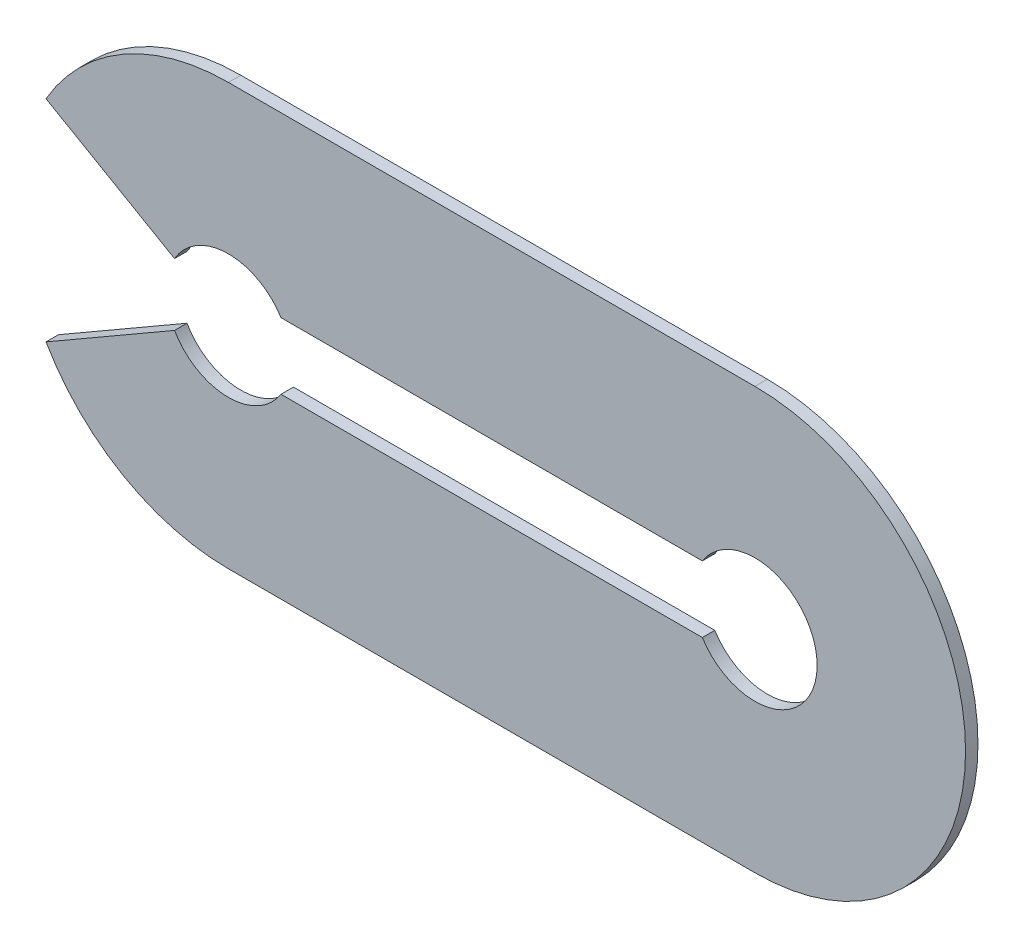
ISO-10303-21;
HEADER;
FILE_DESCRIPTION(('STEP AP214'),'2;1');
FILE_NAME('part.step','',(''),(''),'','','');
FILE_SCHEMA(('AUTOMOTIVE_DESIGN { 1 0 10303 214 1 1 1 1 }'));
ENDSEC;
DATA;
#1=APPLICATION_CONTEXT('core data for automotive mechanical design processes');
#2=APPLICATION_PROTOCOL_DEFINITION('international standard','automotive_design',2000,#1);
#3=PRODUCT_CONTEXT('',#1,'mechanical');
#4=PRODUCT('Part','Part','',(#3));
#5=PRODUCT_RELATED_PRODUCT_CATEGORY('part','',(#4));
#6=PRODUCT_DEFINITION_FORMATION('','',#4);
#7=PRODUCT_DEFINITION_CONTEXT('part definition',#1,'design');
#8=PRODUCT_DEFINITION('design','',#6,#7);
#9=PRODUCT_DEFINITION_SHAPE('','',#8);
#10=(LENGTH_UNIT() NAMED_UNIT(*) SI_UNIT(.MILLI.,.METRE.));
#11=(NAMED_UNIT(*) PLANE_ANGLE_UNIT() SI_UNIT($,.RADIAN.));
#12=(NAMED_UNIT(*) SI_UNIT($,.STERADIAN.) SOLID_ANGLE_UNIT());
#13=UNCERTAINTY_MEASURE_WITH_UNIT(LENGTH_MEASURE(1.E-05),#10,'distance_accuracy_value','');
#14=(GEOMETRIC_REPRESENTATION_CONTEXT(3) GLOBAL_UNCERTAINTY_ASSIGNED_CONTEXT((#13)) GLOBAL_UNIT_ASSIGNED_CONTEXT((#10,
#11,#12)) REPRESENTATION_CONTEXT('',''));
#15=CARTESIAN_POINT('',(0.,0.,0.));
#16=DIRECTION('',(0.,0.,1.));
#17=DIRECTION('',(1.,0.,0.));
#18=AXIS2_PLACEMENT_3D('',#15,#16,#17);
#19=CARTESIAN_POINT('',(-12.7,0.,-0.3));
#20=DIRECTION('',(0.,0.,1.));
#21=DIRECTION('',(1.,0.,0.));
#22=AXIS2_PLACEMENT_3D('',#19,#20,#21);
#23=CYLINDRICAL_SURFACE('',#22,1.5);
#24=CARTESIAN_POINT('',(-12.7,0.,0.));
#25=DIRECTION('',(0.,0.,-1.));
#26=DIRECTION('',(1.,0.,0.));
#27=AXIS2_PLACEMENT_3D('',#24,#25,#26);
#28=CIRCLE('',#27,1.5);
#29=CARTESIAN_POINT('',(-13.9990381056767,0.749999999999993,0.));
#30=VERTEX_POINT('',#29);
#31=CARTESIAN_POINT('',(-11.431142245955,0.799999999999998,0.));
#32=VERTEX_POINT('',#31);
#33=EDGE_CURVE('E120',#30,#32,#28,.T.);
#34=ORIENTED_EDGE('',*,*,#33,.F.);
#35=DIRECTION('',(0.,0.,1.));
#36=VECTOR('',#35,1.);
#37=CARTESIAN_POINT('',(-13.9990381056767,0.749999999999993,-0.3));
#38=LINE('',#37,#36);
#39=CARTESIAN_POINT('',(-13.9990381056767,0.749999999999993,-0.3));
#40=VERTEX_POINT('',#39);
#41=EDGE_CURVE('E11',#40,#30,#38,.T.);
#42=ORIENTED_EDGE('',*,*,#41,.F.);
#43=CARTESIAN_POINT('',(-12.7,0.,-0.3));
#44=DIRECTION('',(0.,0.,-1.));
#45=DIRECTION('',(1.,0.,0.));
#46=AXIS2_PLACEMENT_3D('',#43,#44,#45);
#47=CIRCLE('',#46,1.5);
#48=CARTESIAN_POINT('',(-11.431142245955,0.799999999999998,-0.3));
#49=VERTEX_POINT('',#48);
#50=EDGE_CURVE('E122',#40,#49,#47,.T.);
#51=ORIENTED_EDGE('',*,*,#50,.T.);
#52=DIRECTION('',(0.,0.,1.));
#53=VECTOR('',#52,1.);
#54=CARTESIAN_POINT('',(-11.431142245955,0.799999999999998,-0.3));
#55=LINE('',#54,#53);
#56=EDGE_CURVE('E35',#49,#32,#55,.T.);
#57=ORIENTED_EDGE('',*,*,#56,.T.);
#58=EDGE_LOOP('',(#34,#42,#51,#57));
#59=FACE_BOUND('',#58,.T.);
#60=ADVANCED_FACE('F32',(#59),#23,.F.);
#61=CARTESIAN_POINT('',(-13.9990381056767,0.749999999999993,-0.3));
#62=DIRECTION('',(-0.499999999999995,-0.866025403784441,0.));
#63=DIRECTION('',(0.866025403784442,-0.499999999999995,0.));
#64=AXIS2_PLACEMENT_3D('',#61,#62,#63);
#65=PLANE('',#64);
#66=DIRECTION('',(0.866025403784442,-0.499999999999995,0.));
#67=VECTOR('',#66,1.);
#68=CARTESIAN_POINT('',(-13.9990381056767,0.749999999999993,0.));
#69=LINE('',#68,#67);
#70=CARTESIAN_POINT('',(-17.099409051225,2.53999999999998,0.));
#71=VERTEX_POINT('',#70);
#72=EDGE_CURVE('E138',#71,#30,#69,.T.);
#73=ORIENTED_EDGE('',*,*,#72,.F.);
#74=DIRECTION('',(0.,0.,1.));
#75=VECTOR('',#74,1.);
#76=CARTESIAN_POINT('',(-17.099409051225,2.53999999999998,-0.3));
#77=LINE('',#76,#75);
#78=CARTESIAN_POINT('',(-17.099409051225,2.53999999999998,-0.3));
#79=VERTEX_POINT('',#78);
#80=EDGE_CURVE('E40',#79,#71,#77,.T.);
#81=ORIENTED_EDGE('',*,*,#80,.F.);
#82=DIRECTION('',(0.866025403784442,-0.499999999999995,0.));
#83=VECTOR('',#82,1.);
#84=CARTESIAN_POINT('',(-13.9990381056767,0.749999999999993,-0.3));
#85=LINE('',#84,#83);
#86=EDGE_CURVE('E127',#79,#40,#85,.T.);
#87=ORIENTED_EDGE('',*,*,#86,.T.);
#88=ORIENTED_EDGE('',*,*,#41,.T.);
#89=EDGE_LOOP('',(#73,#81,#87,#88));
#90=FACE_BOUND('',#89,.T.);
#91=ADVANCED_FACE('F245',(#90),#65,.T.);
#92=CARTESIAN_POINT('',(-12.7,0.,-0.3));
#93=DIRECTION('',(0.,0.,1.));
#94=DIRECTION('',(1.,0.,0.));
#95=AXIS2_PLACEMENT_3D('',#92,#93,#94);
#96=CYLINDRICAL_SURFACE('',#95,5.08);
#97=CARTESIAN_POINT('',(-12.7,0.,0.));
#98=DIRECTION('',(0.,0.,1.));
#99=DIRECTION('',(1.,0.,0.));
#100=AXIS2_PLACEMENT_3D('',#97,#98,#99);
#101=CIRCLE('',#100,5.08);
#102=CARTESIAN_POINT('',(-12.7,5.08,0.));
#103=VERTEX_POINT('',#102);
#104=EDGE_CURVE('E163',#103,#71,#101,.T.);
#105=ORIENTED_EDGE('',*,*,#104,.F.);
#106=DIRECTION('',(0.,0.,1.));
#107=VECTOR('',#106,1.);
#108=CARTESIAN_POINT('',(-12.7,5.08,-0.3));
#109=LINE('',#108,#107);
#110=CARTESIAN_POINT('',(-12.7,5.08,-0.3));
#111=VERTEX_POINT('',#110);
#112=EDGE_CURVE('E197',#111,#103,#109,.T.);
#113=ORIENTED_EDGE('',*,*,#112,.F.);
#114=CARTESIAN_POINT('',(-12.7,0.,-0.3));
#115=DIRECTION('',(0.,0.,1.));
#116=DIRECTION('',(1.,0.,0.));
#117=AXIS2_PLACEMENT_3D('',#114,#115,#116);
#118=CIRCLE('',#117,5.08);
#119=EDGE_CURVE('E193',#111,#79,#118,.T.);
#120=ORIENTED_EDGE('',*,*,#119,.T.);
#121=ORIENTED_EDGE('',*,*,#80,.T.);
#122=EDGE_LOOP('',(#105,#113,#120,#121));
#123=FACE_BOUND('',#122,.T.);
#124=ADVANCED_FACE('F250',(#123),#96,.T.);
#125=CARTESIAN_POINT('',(0.,5.08,-0.3));
#126=DIRECTION('',(0.,1.,0.));
#127=DIRECTION('',(0.,0.,1.));
#128=AXIS2_PLACEMENT_3D('',#125,#126,#127);
#129=PLANE('',#128);
#130=DIRECTION('',(-1.,0.,0.));
#131=VECTOR('',#130,1.);
#132=CARTESIAN_POINT('',(0.,5.08,0.));
#133=LINE('',#132,#131);
#134=CARTESIAN_POINT('',(0.,5.08,0.));
#135=VERTEX_POINT('',#134);
#136=EDGE_CURVE('E160',#135,#103,#133,.T.);
#137=ORIENTED_EDGE('',*,*,#136,.F.);
#138=DIRECTION('',(0.,0.,1.));
#139=VECTOR('',#138,1.);
#140=CARTESIAN_POINT('',(0.,5.08,-0.3));
#141=LINE('',#140,#139);
#142=CARTESIAN_POINT('',(0.,5.08,-0.3));
#143=VERTEX_POINT('',#142);
#144=EDGE_CURVE('E199',#143,#135,#141,.T.);
#145=ORIENTED_EDGE('',*,*,#144,.F.);
#146=DIRECTION('',(-1.,0.,0.));
#147=VECTOR('',#146,1.);
#148=CARTESIAN_POINT('',(0.,5.08,-0.3));
#149=LINE('',#148,#147);
#150=EDGE_CURVE('E190',#143,#111,#149,.T.);
#151=ORIENTED_EDGE('',*,*,#150,.T.);
#152=ORIENTED_EDGE('',*,*,#112,.T.);
#153=EDGE_LOOP('',(#137,#145,#151,#152));
#154=FACE_BOUND('',#153,.T.);
#155=ADVANCED_FACE('F242',(#154),#129,.T.);
#156=CARTESIAN_POINT('',(0.,0.,-0.3));
#157=DIRECTION('',(0.,0.,1.));
#158=DIRECTION('',(1.,0.,0.));
#159=AXIS2_PLACEMENT_3D('',#156,#157,#158);
#160=CYLINDRICAL_SURFACE('',#159,5.08);
#161=CARTESIAN_POINT('',(0.,0.,0.));
#162=DIRECTION('',(0.,0.,1.));
#163=DIRECTION('',(1.,0.,0.));
#164=AXIS2_PLACEMENT_3D('',#161,#162,#163);
#165=CIRCLE('',#164,5.08);
#166=CARTESIAN_POINT('',(0.,-5.08,0.));
#167=VERTEX_POINT('',#166);
#168=EDGE_CURVE('E157',#167,#135,#165,.T.);
#169=ORIENTED_EDGE('',*,*,#168,.F.);
#170=DIRECTION('',(0.,0.,1.));
#171=VECTOR('',#170,1.);
#172=CARTESIAN_POINT('',(0.,-5.08,-0.3));
#173=LINE('',#172,#171);
#174=CARTESIAN_POINT('',(0.,-5.08,-0.3));
#175=VERTEX_POINT('',#174);
#176=EDGE_CURVE('E201',#175,#167,#173,.T.);
#177=ORIENTED_EDGE('',*,*,#176,.F.);
#178=CARTESIAN_POINT('',(0.,0.,-0.3));
#179=DIRECTION('',(0.,0.,1.));
#180=DIRECTION('',(1.,0.,0.));
#181=AXIS2_PLACEMENT_3D('',#178,#179,#180);
#182=CIRCLE('',#181,5.08);
#183=EDGE_CURVE('E187',#175,#143,#182,.T.);
#184=ORIENTED_EDGE('',*,*,#183,.T.);
#185=ORIENTED_EDGE('',*,*,#144,.T.);
#186=EDGE_LOOP('',(#169,#177,#184,#185));
#187=FACE_BOUND('',#186,.T.);
#188=ADVANCED_FACE('F238',(#187),#160,.T.);
#189=CARTESIAN_POINT('',(0.,-5.08,-0.3));
#190=DIRECTION('',(0.,-1.,0.));
#191=DIRECTION('',(0.,0.,-1.));
#192=AXIS2_PLACEMENT_3D('',#189,#190,#191);
#193=PLANE('',#192);
#194=DIRECTION('',(1.,0.,0.));
#195=VECTOR('',#194,1.);
#196=CARTESIAN_POINT('',(0.,-5.08,0.));
#197=LINE('',#196,#195);
#198=CARTESIAN_POINT('',(-12.7,-5.08,0.));
#199=VERTEX_POINT('',#198);
#200=EDGE_CURVE('E154',#199,#167,#197,.T.);
#201=ORIENTED_EDGE('',*,*,#200,.F.);
#202=DIRECTION('',(0.,0.,1.));
#203=VECTOR('',#202,1.);
#204=CARTESIAN_POINT('',(-12.7,-5.08,-0.3));
#205=LINE('',#204,#203);
#206=CARTESIAN_POINT('',(-12.7,-5.08,-0.3));
#207=VERTEX_POINT('',#206);
#208=EDGE_CURVE('E203',#207,#199,#205,.T.);
#209=ORIENTED_EDGE('',*,*,#208,.F.);
#210=DIRECTION('',(1.,0.,0.));
#211=VECTOR('',#210,1.);
#212=CARTESIAN_POINT('',(0.,-5.08,-0.3));
#213=LINE('',#212,#211);
#214=EDGE_CURVE('E184',#207,#175,#213,.T.);
#215=ORIENTED_EDGE('',*,*,#214,.T.);
#216=ORIENTED_EDGE('',*,*,#176,.T.);
#217=EDGE_LOOP('',(#201,#209,#215,#216));
#218=FACE_BOUND('',#217,.T.);
#219=ADVANCED_FACE('F234',(#218),#193,.T.);
#220=CARTESIAN_POINT('',(-12.7,0.,-0.3));
#221=DIRECTION('',(0.,0.,1.));
#222=DIRECTION('',(1.,0.,0.));
#223=AXIS2_PLACEMENT_3D('',#220,#221,#222);
#224=CYLINDRICAL_SURFACE('',#223,5.08);
#225=CARTESIAN_POINT('',(-12.7,0.,0.));
#226=DIRECTION('',(0.,0.,1.));
#227=DIRECTION('',(1.,0.,0.));
#228=AXIS2_PLACEMENT_3D('',#225,#226,#227);
#229=CIRCLE('',#228,5.08);
#230=CARTESIAN_POINT('',(-17.099409051225,-2.53999999999997,0.));
#231=VERTEX_POINT('',#230);
#232=EDGE_CURVE('E151',#231,#199,#229,.T.);
#233=ORIENTED_EDGE('',*,*,#232,.F.);
#234=DIRECTION('',(0.,0.,1.));
#235=VECTOR('',#234,1.);
#236=CARTESIAN_POINT('',(-17.099409051225,-2.53999999999997,-0.3));
#237=LINE('',#236,#235);
#238=CARTESIAN_POINT('',(-17.099409051225,-2.53999999999997,-0.3));
#239=VERTEX_POINT('',#238);
#240=EDGE_CURVE('E205',#239,#231,#237,.T.);
#241=ORIENTED_EDGE('',*,*,#240,.F.);
#242=CARTESIAN_POINT('',(-12.7,0.,-0.3));
#243=DIRECTION('',(0.,0.,1.));
#244=DIRECTION('',(1.,0.,0.));
#245=AXIS2_PLACEMENT_3D('',#242,#243,#244);
#246=CIRCLE('',#245,5.08);
#247=EDGE_CURVE('E181',#239,#207,#246,.T.);
#248=ORIENTED_EDGE('',*,*,#247,.T.);
#249=ORIENTED_EDGE('',*,*,#208,.T.);
#250=EDGE_LOOP('',(#233,#241,#248,#249));
#251=FACE_BOUND('',#250,.T.);
#252=ADVANCED_FACE('F230',(#251),#224,.T.);
#253=CARTESIAN_POINT('',(-13.9990381056767,-0.749999999999993,-0.3));
#254=DIRECTION('',(-0.499999999999995,0.866025403784441,0.));
#255=DIRECTION('',(-0.866025403784442,-0.499999999999995,0.));
#256=AXIS2_PLACEMENT_3D('',#253,#254,#255);
#257=PLANE('',#256);
#258=DIRECTION('',(-0.866025403784442,-0.499999999999995,0.));
#259=VECTOR('',#258,1.);
#260=CARTESIAN_POINT('',(-13.9990381056767,-0.749999999999993,0.));
#261=LINE('',#260,#259);
#262=CARTESIAN_POINT('',(-13.9990381056767,-0.749999999999993,0.));
#263=VERTEX_POINT('',#262);
#264=EDGE_CURVE('E148',#263,#231,#261,.T.);
#265=ORIENTED_EDGE('',*,*,#264,.F.);
#266=DIRECTION('',(0.,0.,1.));
#267=VECTOR('',#266,1.);
#268=CARTESIAN_POINT('',(-13.9990381056767,-0.749999999999993,-0.3));
#269=LINE('',#268,#267);
#270=CARTESIAN_POINT('',(-13.9990381056767,-0.749999999999993,-0.3));
#271=VERTEX_POINT('',#270);
#272=EDGE_CURVE('E207',#271,#263,#269,.T.);
#273=ORIENTED_EDGE('',*,*,#272,.F.);
#274=DIRECTION('',(-0.866025403784442,-0.499999999999995,0.));
#275=VECTOR('',#274,1.);
#276=CARTESIAN_POINT('',(-13.9990381056767,-0.749999999999993,-0.3));
#277=LINE('',#276,#275);
#278=EDGE_CURVE('E178',#271,#239,#277,.T.);
#279=ORIENTED_EDGE('',*,*,#278,.T.);
#280=ORIENTED_EDGE('',*,*,#240,.T.);
#281=EDGE_LOOP('',(#265,#273,#279,#280));
#282=FACE_BOUND('',#281,.T.);
#283=ADVANCED_FACE('F226',(#282),#257,.T.);
#284=CARTESIAN_POINT('',(-12.7,0.,-0.3));
#285=DIRECTION('',(0.,0.,1.));
#286=DIRECTION('',(1.,0.,0.));
#287=AXIS2_PLACEMENT_3D('',#284,#285,#286);
#288=CYLINDRICAL_SURFACE('',#287,1.5);
#289=CARTESIAN_POINT('',(-12.7,0.,0.));
#290=DIRECTION('',(0.,0.,-1.));
#291=DIRECTION('',(1.,0.,0.));
#292=AXIS2_PLACEMENT_3D('',#289,#290,#291);
#293=CIRCLE('',#292,1.5);
#294=CARTESIAN_POINT('',(-11.431142245955,-0.800000000000002,0.));
#295=VERTEX_POINT('',#294);
#296=EDGE_CURVE('E145',#295,#263,#293,.T.);
#297=ORIENTED_EDGE('',*,*,#296,.F.);
#298=DIRECTION('',(0.,0.,1.));
#299=VECTOR('',#298,1.);
#300=CARTESIAN_POINT('',(-11.431142245955,-0.800000000000002,-0.3));
#301=LINE('',#300,#299);
#302=CARTESIAN_POINT('',(-11.431142245955,-0.800000000000002,-0.3));
#303=VERTEX_POINT('',#302);
#304=EDGE_CURVE('E209',#303,#295,#301,.T.);
#305=ORIENTED_EDGE('',*,*,#304,.F.);
#306=CARTESIAN_POINT('',(-12.7,0.,-0.3));
#307=DIRECTION('',(0.,0.,-1.));
#308=DIRECTION('',(1.,0.,0.));
#309=AXIS2_PLACEMENT_3D('',#306,#307,#308);
#310=CIRCLE('',#309,1.5);
#311=EDGE_CURVE('E175',#303,#271,#310,.T.);
#312=ORIENTED_EDGE('',*,*,#311,.T.);
#313=ORIENTED_EDGE('',*,*,#272,.T.);
#314=EDGE_LOOP('',(#297,#305,#312,#313));
#315=FACE_BOUND('',#314,.T.);
#316=ADVANCED_FACE('F222',(#315),#288,.F.);
#317=CARTESIAN_POINT('',(-1.26885775404495,-0.8,-0.3));
#318=DIRECTION('',(0.,1.,0.));
#319=DIRECTION('',(-1.,0.,0.));
#320=AXIS2_PLACEMENT_3D('',#317,#318,#319);
#321=PLANE('',#320);
#322=DIRECTION('',(-1.,0.,0.));
#323=VECTOR('',#322,1.);
#324=CARTESIAN_POINT('',(-1.26885775404495,-0.8,0.));
#325=LINE('',#324,#323);
#326=CARTESIAN_POINT('',(-1.26885775404495,-0.8,0.));
#327=VERTEX_POINT('',#326);
#328=EDGE_CURVE('E142',#327,#295,#325,.T.);
#329=ORIENTED_EDGE('',*,*,#328,.F.);
#330=DIRECTION('',(0.,0.,1.));
#331=VECTOR('',#330,1.);
#332=CARTESIAN_POINT('',(-1.26885775404495,-0.8,-0.3));
#333=LINE('',#332,#331);
#334=CARTESIAN_POINT('',(-1.26885775404495,-0.8,-0.3));
#335=VERTEX_POINT('',#334);
#336=EDGE_CURVE('E211',#335,#327,#333,.T.);
#337=ORIENTED_EDGE('',*,*,#336,.F.);
#338=DIRECTION('',(-1.,0.,0.));
#339=VECTOR('',#338,1.);
#340=CARTESIAN_POINT('',(-1.26885775404495,-0.8,-0.3));
#341=LINE('',#340,#339);
#342=EDGE_CURVE('E172',#335,#303,#341,.T.);
#343=ORIENTED_EDGE('',*,*,#342,.T.);
#344=ORIENTED_EDGE('',*,*,#304,.T.);
#345=EDGE_LOOP('',(#329,#337,#343,#344));
#346=FACE_BOUND('',#345,.T.);
#347=ADVANCED_FACE('F218',(#346),#321,.T.);
#348=CARTESIAN_POINT('',(0.,0.,-0.3));
#349=DIRECTION('',(0.,0.,1.));
#350=DIRECTION('',(1.,0.,0.));
#351=AXIS2_PLACEMENT_3D('',#348,#349,#350);
#352=CYLINDRICAL_SURFACE('',#351,1.5);
#353=CARTESIAN_POINT('',(0.,0.,0.));
#354=DIRECTION('',(0.,0.,-1.));
#355=DIRECTION('',(1.,0.,0.));
#356=AXIS2_PLACEMENT_3D('',#353,#354,#355);
#357=CIRCLE('',#356,1.5);
#358=CARTESIAN_POINT('',(-1.26885775404495,0.799999999999997,0.));
#359=VERTEX_POINT('',#358);
#360=EDGE_CURVE('E134',#359,#327,#357,.T.);
#361=ORIENTED_EDGE('',*,*,#360,.F.);
#362=DIRECTION('',(0.,0.,1.));
#363=VECTOR('',#362,1.);
#364=CARTESIAN_POINT('',(-1.26885775404495,0.799999999999997,-0.3));
#365=LINE('',#364,#363);
#366=CARTESIAN_POINT('',(-1.26885775404495,0.799999999999997,-0.3));
#367=VERTEX_POINT('',#366);
#368=EDGE_CURVE('E126',#367,#359,#365,.T.);
#369=ORIENTED_EDGE('',*,*,#368,.F.);
#370=CARTESIAN_POINT('',(0.,0.,-0.3));
#371=DIRECTION('',(0.,0.,-1.));
#372=DIRECTION('',(1.,0.,0.));
#373=AXIS2_PLACEMENT_3D('',#370,#371,#372);
#374=CIRCLE('',#373,1.5);
#375=EDGE_CURVE('E169',#367,#335,#374,.T.);
#376=ORIENTED_EDGE('',*,*,#375,.T.);
#377=ORIENTED_EDGE('',*,*,#336,.T.);
#378=EDGE_LOOP('',(#361,#369,#376,#377));
#379=FACE_BOUND('',#378,.T.);
#380=ADVANCED_FACE('F214',(#379),#352,.F.);
#381=CARTESIAN_POINT('',(-11.431142245955,0.799999999999998,-0.3));
#382=DIRECTION('',(0.,-1.,0.));
#383=DIRECTION('',(0.,0.,-1.));
#384=AXIS2_PLACEMENT_3D('',#381,#382,#383);
#385=PLANE('',#384);
#386=DIRECTION('',(1.,0.,0.));
#387=VECTOR('',#386,1.);
#388=CARTESIAN_POINT('',(-11.431142245955,0.799999999999998,0.));
#389=LINE('',#388,#387);
#390=EDGE_CURVE('E129',#32,#359,#389,.T.);
#391=ORIENTED_EDGE('',*,*,#390,.F.);
#392=ORIENTED_EDGE('',*,*,#56,.F.);
#393=DIRECTION('',(1.,0.,0.));
#394=VECTOR('',#393,1.);
#395=CARTESIAN_POINT('',(-11.431142245955,0.799999999999998,-0.3));
#396=LINE('',#395,#394);
#397=EDGE_CURVE('E167',#49,#367,#396,.T.);
#398=ORIENTED_EDGE('',*,*,#397,.T.);
#399=ORIENTED_EDGE('',*,*,#368,.T.);
#400=EDGE_LOOP('',(#391,#392,#398,#399));
#401=FACE_BOUND('',#400,.T.);
#402=ADVANCED_FACE('F130',(#401),#385,.T.);
#403=CARTESIAN_POINT('',(-12.7,0.,-0.3));
#404=DIRECTION('',(0.,0.,1.));
#405=DIRECTION('',(1.,0.,0.));
#406=AXIS2_PLACEMENT_3D('',#403,#404,#405);
#407=PLANE('',#406);
#408=ORIENTED_EDGE('',*,*,#50,.F.);
#409=ORIENTED_EDGE('',*,*,#86,.F.);
#410=ORIENTED_EDGE('',*,*,#119,.F.);
#411=ORIENTED_EDGE('',*,*,#150,.F.);
#412=ORIENTED_EDGE('',*,*,#183,.F.);
#413=ORIENTED_EDGE('',*,*,#214,.F.);
#414=ORIENTED_EDGE('',*,*,#247,.F.);
#415=ORIENTED_EDGE('',*,*,#278,.F.);
#416=ORIENTED_EDGE('',*,*,#311,.F.);
#417=ORIENTED_EDGE('',*,*,#342,.F.);
#418=ORIENTED_EDGE('',*,*,#375,.F.);
#419=ORIENTED_EDGE('',*,*,#397,.F.);
#420=EDGE_LOOP('',(#408,#409,#410,#411,#412,#413,#414,#415,#416,#417,#418,#419));
#421=FACE_BOUND('',#420,.T.);
#422=ADVANCED_FACE('F249',(#421),#407,.F.);
#423=CARTESIAN_POINT('',(-12.7,0.,0.));
#424=DIRECTION('',(0.,0.,1.));
#425=DIRECTION('',(1.,0.,0.));
#426=AXIS2_PLACEMENT_3D('',#423,#424,#425);
#427=PLANE('',#426);
#428=ORIENTED_EDGE('',*,*,#33,.T.);
#429=ORIENTED_EDGE('',*,*,#390,.T.);
#430=ORIENTED_EDGE('',*,*,#360,.T.);
#431=ORIENTED_EDGE('',*,*,#328,.T.);
#432=ORIENTED_EDGE('',*,*,#296,.T.);
#433=ORIENTED_EDGE('',*,*,#264,.T.);
#434=ORIENTED_EDGE('',*,*,#232,.T.);
#435=ORIENTED_EDGE('',*,*,#200,.T.);
#436=ORIENTED_EDGE('',*,*,#168,.T.);
#437=ORIENTED_EDGE('',*,*,#136,.T.);
#438=ORIENTED_EDGE('',*,*,#104,.T.);
#439=ORIENTED_EDGE('',*,*,#72,.T.);
#440=EDGE_LOOP('',(#428,#429,#430,#431,#432,#433,#434,#435,#436,#437,#438,#439));
#441=FACE_BOUND('',#440,.T.);
#442=ADVANCED_FACE('F136',(#441),#427,.T.);
#443=CLOSED_SHELL('',(#60,#91,#124,#155,#188,#219,#252,#283,#316,#347,#380,#402,#422,#442));
#444=MANIFOLD_SOLID_BREP('B2',#443);
#445=ADVANCED_BREP_SHAPE_REPRESENTATION('',(#18,#444),#14);
#446=SHAPE_DEFINITION_REPRESENTATION(#9,#445);
ENDSEC;
END-ISO-10303-21;
